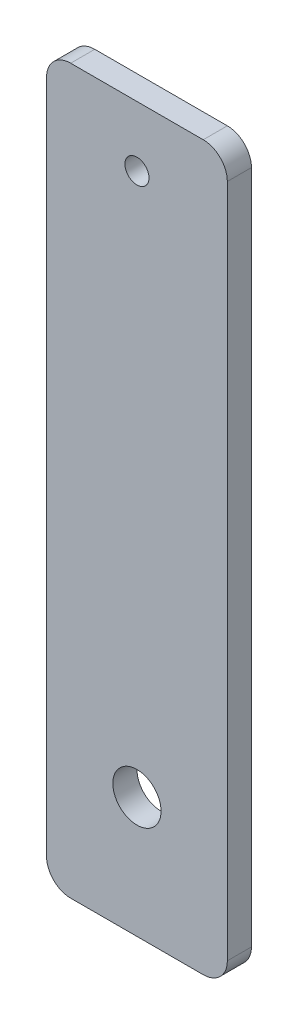
ISO-10303-21;
HEADER;
FILE_DESCRIPTION(('STEP AP214'),'2;1');
FILE_NAME('part.step','',(''),(''),'','','');
FILE_SCHEMA(('AUTOMOTIVE_DESIGN { 1 0 10303 214 1 1 1 1 }'));
ENDSEC;
DATA;
#1=APPLICATION_CONTEXT('core data for automotive mechanical design processes');
#2=APPLICATION_PROTOCOL_DEFINITION('international standard','automotive_design',2000,#1);
#3=PRODUCT_CONTEXT('',#1,'mechanical');
#4=PRODUCT('Part','Part','',(#3));
#5=PRODUCT_RELATED_PRODUCT_CATEGORY('part','',(#4));
#6=PRODUCT_DEFINITION_FORMATION('','',#4);
#7=PRODUCT_DEFINITION_CONTEXT('part definition',#1,'design');
#8=PRODUCT_DEFINITION('design','',#6,#7);
#9=PRODUCT_DEFINITION_SHAPE('','',#8);
#10=(LENGTH_UNIT() NAMED_UNIT(*) SI_UNIT(.MILLI.,.METRE.));
#11=(NAMED_UNIT(*) PLANE_ANGLE_UNIT() SI_UNIT($,.RADIAN.));
#12=(NAMED_UNIT(*) SI_UNIT($,.STERADIAN.) SOLID_ANGLE_UNIT());
#13=UNCERTAINTY_MEASURE_WITH_UNIT(LENGTH_MEASURE(1.E-05),#10,'distance_accuracy_value','');
#14=(GEOMETRIC_REPRESENTATION_CONTEXT(3) GLOBAL_UNCERTAINTY_ASSIGNED_CONTEXT((#13)) GLOBAL_UNIT_ASSIGNED_CONTEXT((#10,
#11,#12)) REPRESENTATION_CONTEXT('',''));
#15=CARTESIAN_POINT('',(0.,0.,0.));
#16=DIRECTION('',(0.,0.,1.));
#17=DIRECTION('',(1.,0.,0.));
#18=AXIS2_PLACEMENT_3D('',#15,#16,#17);
#19=CARTESIAN_POINT('',(0.,0.,2.));
#20=DIRECTION('',(0.,0.,1.));
#21=DIRECTION('',(1.,0.,0.));
#22=AXIS2_PLACEMENT_3D('',#19,#20,#21);
#23=PLANE('',#22);
#24=CARTESIAN_POINT('',(0.,-20.,2.));
#25=DIRECTION('',(0.,0.,1.));
#26=DIRECTION('',(1.,0.,0.));
#27=AXIS2_PLACEMENT_3D('',#24,#25,#26);
#28=CIRCLE('',#27,2.);
#29=CARTESIAN_POINT('',(2.,-20.,2.));
#30=VERTEX_POINT('',#29);
#31=EDGE_CURVE('E127',#30,#30,#28,.T.);
#32=ORIENTED_EDGE('',*,*,#31,.F.);
#33=EDGE_LOOP('',(#32));
#34=FACE_BOUND('',#33,.T.);
#35=DIRECTION('',(1.,0.,0.));
#36=VECTOR('',#35,1.);
#37=CARTESIAN_POINT('',(-7.5,-30.,2.));
#38=LINE('',#37,#36);
#39=CARTESIAN_POINT('',(-5.5,-30.,2.));
#40=VERTEX_POINT('',#39);
#41=CARTESIAN_POINT('',(5.5,-30.,2.));
#42=VERTEX_POINT('',#41);
#43=EDGE_CURVE('E136',#40,#42,#38,.T.);
#44=ORIENTED_EDGE('',*,*,#43,.T.);
#45=CARTESIAN_POINT('',(5.5,-28.,2.));
#46=DIRECTION('',(0.,0.,1.));
#47=DIRECTION('',(1.,0.,0.));
#48=AXIS2_PLACEMENT_3D('',#45,#46,#47);
#49=CIRCLE('',#48,2.);
#50=CARTESIAN_POINT('',(7.5,-28.,2.));
#51=VERTEX_POINT('',#50);
#52=EDGE_CURVE('E155',#42,#51,#49,.T.);
#53=ORIENTED_EDGE('',*,*,#52,.T.);
#54=DIRECTION('',(0.,1.,0.));
#55=VECTOR('',#54,1.);
#56=CARTESIAN_POINT('',(7.5,30.,2.));
#57=LINE('',#56,#55);
#58=CARTESIAN_POINT('',(7.5,28.,2.));
#59=VERTEX_POINT('',#58);
#60=EDGE_CURVE('E119',#51,#59,#57,.T.);
#61=ORIENTED_EDGE('',*,*,#60,.T.);
#62=CARTESIAN_POINT('',(5.5,28.,2.));
#63=DIRECTION('',(0.,0.,1.));
#64=DIRECTION('',(1.,0.,0.));
#65=AXIS2_PLACEMENT_3D('',#62,#63,#64);
#66=CIRCLE('',#65,2.);
#67=CARTESIAN_POINT('',(5.5,30.,2.));
#68=VERTEX_POINT('',#67);
#69=EDGE_CURVE('E150',#59,#68,#66,.T.);
#70=ORIENTED_EDGE('',*,*,#69,.T.);
#71=DIRECTION('',(-1.,0.,0.));
#72=VECTOR('',#71,1.);
#73=CARTESIAN_POINT('',(-7.5,30.,2.));
#74=LINE('',#73,#72);
#75=CARTESIAN_POINT('',(-5.5,30.,2.));
#76=VERTEX_POINT('',#75);
#77=EDGE_CURVE('E166',#68,#76,#74,.T.);
#78=ORIENTED_EDGE('',*,*,#77,.T.);
#79=CARTESIAN_POINT('',(-5.5,28.,2.));
#80=DIRECTION('',(0.,0.,1.));
#81=DIRECTION('',(1.,0.,0.));
#82=AXIS2_PLACEMENT_3D('',#79,#80,#81);
#83=CIRCLE('',#82,2.);
#84=CARTESIAN_POINT('',(-7.5,28.,2.));
#85=VERTEX_POINT('',#84);
#86=EDGE_CURVE('E55',#76,#85,#83,.T.);
#87=ORIENTED_EDGE('',*,*,#86,.T.);
#88=DIRECTION('',(0.,-1.,0.));
#89=VECTOR('',#88,1.);
#90=CARTESIAN_POINT('',(-7.5,30.,2.));
#91=LINE('',#90,#89);
#92=CARTESIAN_POINT('',(-7.5,-28.,2.));
#93=VERTEX_POINT('',#92);
#94=EDGE_CURVE('E174',#85,#93,#91,.T.);
#95=ORIENTED_EDGE('',*,*,#94,.T.);
#96=CARTESIAN_POINT('',(-5.5,-28.,2.));
#97=DIRECTION('',(0.,0.,1.));
#98=DIRECTION('',(1.,0.,0.));
#99=AXIS2_PLACEMENT_3D('',#96,#97,#98);
#100=CIRCLE('',#99,2.);
#101=EDGE_CURVE('E153',#93,#40,#100,.T.);
#102=ORIENTED_EDGE('',*,*,#101,.T.);
#103=EDGE_LOOP('',(#44,#53,#61,#70,#78,#87,#95,#102));
#104=FACE_BOUND('',#103,.T.);
#105=CARTESIAN_POINT('',(0.,25.,2.));
#106=DIRECTION('',(0.,0.,1.));
#107=DIRECTION('',(1.,0.,0.));
#108=AXIS2_PLACEMENT_3D('',#105,#106,#107);
#109=CIRCLE('',#108,1.);
#110=CARTESIAN_POINT('',(1.,25.,2.));
#111=VERTEX_POINT('',#110);
#112=EDGE_CURVE('E181',#111,#111,#109,.T.);
#113=ORIENTED_EDGE('',*,*,#112,.F.);
#114=EDGE_LOOP('',(#113));
#115=FACE_BOUND('',#114,.T.);
#116=ADVANCED_FACE('F33',(#34,#104,#115),#23,.T.);
#117=CARTESIAN_POINT('',(0.,0.,0.));
#118=DIRECTION('',(0.,0.,1.));
#119=DIRECTION('',(1.,0.,0.));
#120=AXIS2_PLACEMENT_3D('',#117,#118,#119);
#121=PLANE('',#120);
#122=DIRECTION('',(0.,1.,0.));
#123=VECTOR('',#122,1.);
#124=CARTESIAN_POINT('',(7.5,30.,0.));
#125=LINE('',#124,#123);
#126=CARTESIAN_POINT('',(7.5,-28.,0.));
#127=VERTEX_POINT('',#126);
#128=CARTESIAN_POINT('',(7.5,28.,0.));
#129=VERTEX_POINT('',#128);
#130=EDGE_CURVE('E116',#127,#129,#125,.T.);
#131=ORIENTED_EDGE('',*,*,#130,.F.);
#132=CARTESIAN_POINT('',(5.5,-28.,0.));
#133=DIRECTION('',(0.,0.,1.));
#134=DIRECTION('',(1.,0.,0.));
#135=AXIS2_PLACEMENT_3D('',#132,#133,#134);
#136=CIRCLE('',#135,2.);
#137=CARTESIAN_POINT('',(5.5,-30.,0.));
#138=VERTEX_POINT('',#137);
#139=EDGE_CURVE('E99',#127,#138,#136,.F.);
#140=ORIENTED_EDGE('',*,*,#139,.T.);
#141=DIRECTION('',(1.,0.,0.));
#142=VECTOR('',#141,1.);
#143=CARTESIAN_POINT('',(-7.5,-30.,0.));
#144=LINE('',#143,#142);
#145=CARTESIAN_POINT('',(-5.5,-30.,0.));
#146=VERTEX_POINT('',#145);
#147=EDGE_CURVE('E140',#146,#138,#144,.T.);
#148=ORIENTED_EDGE('',*,*,#147,.F.);
#149=CARTESIAN_POINT('',(-5.5,-28.,0.));
#150=DIRECTION('',(0.,0.,1.));
#151=DIRECTION('',(1.,0.,0.));
#152=AXIS2_PLACEMENT_3D('',#149,#150,#151);
#153=CIRCLE('',#152,2.);
#154=CARTESIAN_POINT('',(-7.5,-28.,0.));
#155=VERTEX_POINT('',#154);
#156=EDGE_CURVE('E110',#146,#155,#153,.F.);
#157=ORIENTED_EDGE('',*,*,#156,.T.);
#158=DIRECTION('',(0.,-1.,0.));
#159=VECTOR('',#158,1.);
#160=CARTESIAN_POINT('',(-7.5,30.,0.));
#161=LINE('',#160,#159);
#162=CARTESIAN_POINT('',(-7.5,28.,0.));
#163=VERTEX_POINT('',#162);
#164=EDGE_CURVE('E130',#163,#155,#161,.T.);
#165=ORIENTED_EDGE('',*,*,#164,.F.);
#166=CARTESIAN_POINT('',(-5.5,28.,0.));
#167=DIRECTION('',(0.,0.,1.));
#168=DIRECTION('',(1.,0.,0.));
#169=AXIS2_PLACEMENT_3D('',#166,#167,#168);
#170=CIRCLE('',#169,2.);
#171=CARTESIAN_POINT('',(-5.5,30.,0.));
#172=VERTEX_POINT('',#171);
#173=EDGE_CURVE('E144',#163,#172,#170,.F.);
#174=ORIENTED_EDGE('',*,*,#173,.T.);
#175=DIRECTION('',(-1.,0.,0.));
#176=VECTOR('',#175,1.);
#177=CARTESIAN_POINT('',(-7.5,30.,0.));
#178=LINE('',#177,#176);
#179=CARTESIAN_POINT('',(5.5,30.,0.));
#180=VERTEX_POINT('',#179);
#181=EDGE_CURVE('E126',#180,#172,#178,.T.);
#182=ORIENTED_EDGE('',*,*,#181,.F.);
#183=CARTESIAN_POINT('',(5.5,28.,0.));
#184=DIRECTION('',(0.,0.,1.));
#185=DIRECTION('',(1.,0.,0.));
#186=AXIS2_PLACEMENT_3D('',#183,#184,#185);
#187=CIRCLE('',#186,2.);
#188=EDGE_CURVE('E120',#180,#129,#187,.F.);
#189=ORIENTED_EDGE('',*,*,#188,.T.);
#190=EDGE_LOOP('',(#131,#140,#148,#157,#165,#174,#182,#189));
#191=FACE_BOUND('',#190,.T.);
#192=CARTESIAN_POINT('',(0.,-20.,0.));
#193=DIRECTION('',(0.,0.,1.));
#194=DIRECTION('',(1.,0.,0.));
#195=AXIS2_PLACEMENT_3D('',#192,#193,#194);
#196=CIRCLE('',#195,2.);
#197=CARTESIAN_POINT('',(2.,-20.,0.));
#198=VERTEX_POINT('',#197);
#199=EDGE_CURVE('E133',#198,#198,#196,.T.);
#200=ORIENTED_EDGE('',*,*,#199,.T.);
#201=EDGE_LOOP('',(#200));
#202=FACE_BOUND('',#201,.T.);
#203=CARTESIAN_POINT('',(0.,25.,0.));
#204=DIRECTION('',(0.,0.,1.));
#205=DIRECTION('',(1.,0.,0.));
#206=AXIS2_PLACEMENT_3D('',#203,#204,#205);
#207=CIRCLE('',#206,1.);
#208=CARTESIAN_POINT('',(1.,25.,0.));
#209=VERTEX_POINT('',#208);
#210=EDGE_CURVE('E183',#209,#209,#207,.T.);
#211=ORIENTED_EDGE('',*,*,#210,.T.);
#212=EDGE_LOOP('',(#211));
#213=FACE_BOUND('',#212,.T.);
#214=ADVANCED_FACE('F123',(#191,#202,#213),#121,.F.);
#215=CARTESIAN_POINT('',(7.5,30.,2.));
#216=DIRECTION('',(-1.,0.,0.));
#217=DIRECTION('',(0.,-1.,0.));
#218=AXIS2_PLACEMENT_3D('',#215,#216,#217);
#219=PLANE('',#218);
#220=ORIENTED_EDGE('',*,*,#60,.F.);
#221=DIRECTION('',(0.,0.,-1.));
#222=VECTOR('',#221,1.);
#223=CARTESIAN_POINT('',(7.5,-28.,2.));
#224=LINE('',#223,#222);
#225=EDGE_CURVE('E103',#51,#127,#224,.T.);
#226=ORIENTED_EDGE('',*,*,#225,.T.);
#227=ORIENTED_EDGE('',*,*,#130,.T.);
#228=DIRECTION('',(0.,0.,-1.));
#229=VECTOR('',#228,1.);
#230=CARTESIAN_POINT('',(7.5,28.,2.));
#231=LINE('',#230,#229);
#232=EDGE_CURVE('E121',#129,#59,#231,.F.);
#233=ORIENTED_EDGE('',*,*,#232,.T.);
#234=EDGE_LOOP('',(#220,#226,#227,#233));
#235=FACE_BOUND('',#234,.T.);
#236=ADVANCED_FACE('F115',(#235),#219,.F.);
#237=CARTESIAN_POINT('',(-7.5,30.,2.));
#238=DIRECTION('',(0.,-1.,0.));
#239=DIRECTION('',(0.,0.,-1.));
#240=AXIS2_PLACEMENT_3D('',#237,#238,#239);
#241=PLANE('',#240);
#242=ORIENTED_EDGE('',*,*,#181,.T.);
#243=DIRECTION('',(0.,0.,-1.));
#244=VECTOR('',#243,1.);
#245=CARTESIAN_POINT('',(-5.5,30.,2.));
#246=LINE('',#245,#244);
#247=EDGE_CURVE('E11',#172,#76,#246,.F.);
#248=ORIENTED_EDGE('',*,*,#247,.T.);
#249=ORIENTED_EDGE('',*,*,#77,.F.);
#250=DIRECTION('',(0.,0.,-1.));
#251=VECTOR('',#250,1.);
#252=CARTESIAN_POINT('',(5.5,30.,2.));
#253=LINE('',#252,#251);
#254=EDGE_CURVE('E41',#68,#180,#253,.T.);
#255=ORIENTED_EDGE('',*,*,#254,.T.);
#256=EDGE_LOOP('',(#242,#248,#249,#255));
#257=FACE_BOUND('',#256,.T.);
#258=ADVANCED_FACE('F164',(#257),#241,.F.);
#259=CARTESIAN_POINT('',(-7.5,30.,2.));
#260=DIRECTION('',(1.,0.,0.));
#261=DIRECTION('',(0.,1.,0.));
#262=AXIS2_PLACEMENT_3D('',#259,#260,#261);
#263=PLANE('',#262);
#264=ORIENTED_EDGE('',*,*,#164,.T.);
#265=DIRECTION('',(0.,0.,-1.));
#266=VECTOR('',#265,1.);
#267=CARTESIAN_POINT('',(-7.5,-28.,2.));
#268=LINE('',#267,#266);
#269=EDGE_CURVE('E48',#155,#93,#268,.F.);
#270=ORIENTED_EDGE('',*,*,#269,.T.);
#271=ORIENTED_EDGE('',*,*,#94,.F.);
#272=DIRECTION('',(0.,0.,-1.));
#273=VECTOR('',#272,1.);
#274=CARTESIAN_POINT('',(-7.5,28.,2.));
#275=LINE('',#274,#273);
#276=EDGE_CURVE('E157',#85,#163,#275,.T.);
#277=ORIENTED_EDGE('',*,*,#276,.T.);
#278=EDGE_LOOP('',(#264,#270,#271,#277));
#279=FACE_BOUND('',#278,.T.);
#280=ADVANCED_FACE('F173',(#279),#263,.F.);
#281=CARTESIAN_POINT('',(-7.5,-30.,2.));
#282=DIRECTION('',(0.,1.,0.));
#283=DIRECTION('',(0.,0.,1.));
#284=AXIS2_PLACEMENT_3D('',#281,#282,#283);
#285=PLANE('',#284);
#286=ORIENTED_EDGE('',*,*,#147,.T.);
#287=DIRECTION('',(0.,0.,-1.));
#288=VECTOR('',#287,1.);
#289=CARTESIAN_POINT('',(5.5,-30.,2.));
#290=LINE('',#289,#288);
#291=EDGE_CURVE('E104',#138,#42,#290,.F.);
#292=ORIENTED_EDGE('',*,*,#291,.T.);
#293=ORIENTED_EDGE('',*,*,#43,.F.);
#294=DIRECTION('',(0.,0.,-1.));
#295=VECTOR('',#294,1.);
#296=CARTESIAN_POINT('',(-5.5,-30.,2.));
#297=LINE('',#296,#295);
#298=EDGE_CURVE('E109',#40,#146,#297,.T.);
#299=ORIENTED_EDGE('',*,*,#298,.T.);
#300=EDGE_LOOP('',(#286,#292,#293,#299));
#301=FACE_BOUND('',#300,.T.);
#302=ADVANCED_FACE('F204',(#301),#285,.F.);
#303=CARTESIAN_POINT('',(0.,-20.,2.));
#304=DIRECTION('',(0.,0.,-1.));
#305=DIRECTION('',(-1.,0.,0.));
#306=AXIS2_PLACEMENT_3D('',#303,#304,#305);
#307=CYLINDRICAL_SURFACE('',#306,2.);
#308=ORIENTED_EDGE('',*,*,#31,.T.);
#309=EDGE_LOOP('',(#308));
#310=FACE_BOUND('',#309,.T.);
#311=ORIENTED_EDGE('',*,*,#199,.F.);
#312=EDGE_LOOP('',(#311));
#313=FACE_BOUND('',#312,.T.);
#314=ADVANCED_FACE('F201',(#310,#313),#307,.F.);
#315=CARTESIAN_POINT('',(0.,25.,2.));
#316=DIRECTION('',(0.,0.,-1.));
#317=DIRECTION('',(-1.,0.,0.));
#318=AXIS2_PLACEMENT_3D('',#315,#316,#317);
#319=CYLINDRICAL_SURFACE('',#318,1.);
#320=ORIENTED_EDGE('',*,*,#112,.T.);
#321=EDGE_LOOP('',(#320));
#322=FACE_BOUND('',#321,.T.);
#323=ORIENTED_EDGE('',*,*,#210,.F.);
#324=EDGE_LOOP('',(#323));
#325=FACE_BOUND('',#324,.T.);
#326=ADVANCED_FACE('F189',(#322,#325),#319,.F.);
#327=CARTESIAN_POINT('',(5.5,-28.,2.));
#328=DIRECTION('',(0.,0.,-1.));
#329=DIRECTION('',(-1.,0.,0.));
#330=AXIS2_PLACEMENT_3D('',#327,#328,#329);
#331=CYLINDRICAL_SURFACE('',#330,2.);
#332=ORIENTED_EDGE('',*,*,#52,.F.);
#333=ORIENTED_EDGE('',*,*,#291,.F.);
#334=ORIENTED_EDGE('',*,*,#139,.F.);
#335=ORIENTED_EDGE('',*,*,#225,.F.);
#336=EDGE_LOOP('',(#332,#333,#334,#335));
#337=FACE_BOUND('',#336,.T.);
#338=ADVANCED_FACE('F102',(#337),#331,.T.);
#339=CARTESIAN_POINT('',(-5.5,-28.,2.));
#340=DIRECTION('',(0.,0.,-1.));
#341=DIRECTION('',(-1.,0.,0.));
#342=AXIS2_PLACEMENT_3D('',#339,#340,#341);
#343=CYLINDRICAL_SURFACE('',#342,2.);
#344=ORIENTED_EDGE('',*,*,#101,.F.);
#345=ORIENTED_EDGE('',*,*,#269,.F.);
#346=ORIENTED_EDGE('',*,*,#156,.F.);
#347=ORIENTED_EDGE('',*,*,#298,.F.);
#348=EDGE_LOOP('',(#344,#345,#346,#347));
#349=FACE_BOUND('',#348,.T.);
#350=ADVANCED_FACE('F216',(#349),#343,.T.);
#351=CARTESIAN_POINT('',(-5.5,28.,2.));
#352=DIRECTION('',(0.,0.,-1.));
#353=DIRECTION('',(-1.,0.,0.));
#354=AXIS2_PLACEMENT_3D('',#351,#352,#353);
#355=CYLINDRICAL_SURFACE('',#354,2.);
#356=ORIENTED_EDGE('',*,*,#86,.F.);
#357=ORIENTED_EDGE('',*,*,#247,.F.);
#358=ORIENTED_EDGE('',*,*,#173,.F.);
#359=ORIENTED_EDGE('',*,*,#276,.F.);
#360=EDGE_LOOP('',(#356,#357,#358,#359));
#361=FACE_BOUND('',#360,.T.);
#362=ADVANCED_FACE('F172',(#361),#355,.T.);
#363=CARTESIAN_POINT('',(5.5,28.,2.));
#364=DIRECTION('',(0.,0.,-1.));
#365=DIRECTION('',(-1.,0.,0.));
#366=AXIS2_PLACEMENT_3D('',#363,#364,#365);
#367=CYLINDRICAL_SURFACE('',#366,2.);
#368=ORIENTED_EDGE('',*,*,#69,.F.);
#369=ORIENTED_EDGE('',*,*,#232,.F.);
#370=ORIENTED_EDGE('',*,*,#188,.F.);
#371=ORIENTED_EDGE('',*,*,#254,.F.);
#372=EDGE_LOOP('',(#368,#369,#370,#371));
#373=FACE_BOUND('',#372,.T.);
#374=ADVANCED_FACE('F35',(#373),#367,.T.);
#375=CLOSED_SHELL('',(#116,#214,#236,#258,#280,#302,#314,#326,#338,#350,#362,#374));
#376=MANIFOLD_SOLID_BREP('B2',#375);
#377=ADVANCED_BREP_SHAPE_REPRESENTATION('',(#18,#376),#14);
#378=SHAPE_DEFINITION_REPRESENTATION(#9,#377);
ENDSEC;
END-ISO-10303-21;
